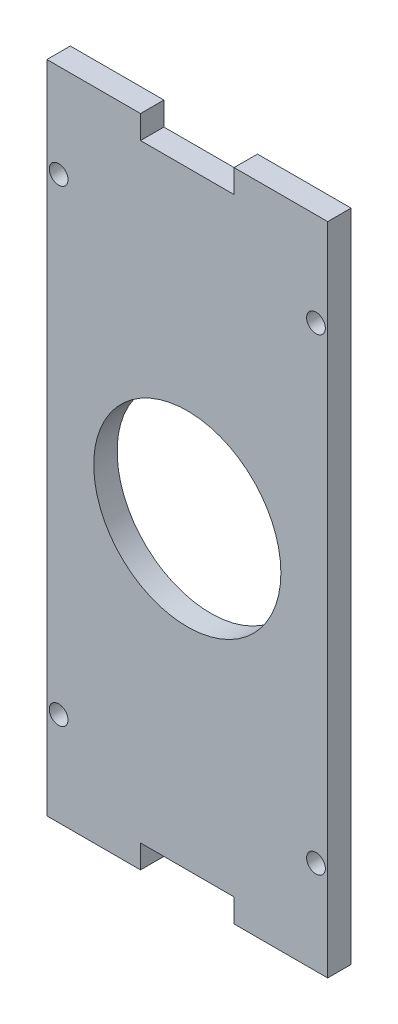
ISO-10303-21;
HEADER;
FILE_DESCRIPTION(('STEP AP214'),'2;1');
FILE_NAME('part.step','',(''),(''),'','','');
FILE_SCHEMA(('AUTOMOTIVE_DESIGN { 1 0 10303 214 1 1 1 1 }'));
ENDSEC;
DATA;
#1=APPLICATION_CONTEXT('core data for automotive mechanical design processes');
#2=APPLICATION_PROTOCOL_DEFINITION('international standard','automotive_design',2000,#1);
#3=PRODUCT_CONTEXT('',#1,'mechanical');
#4=PRODUCT('Part','Part','',(#3));
#5=PRODUCT_RELATED_PRODUCT_CATEGORY('part','',(#4));
#6=PRODUCT_DEFINITION_FORMATION('','',#4);
#7=PRODUCT_DEFINITION_CONTEXT('part definition',#1,'design');
#8=PRODUCT_DEFINITION('design','',#6,#7);
#9=PRODUCT_DEFINITION_SHAPE('','',#8);
#10=(LENGTH_UNIT() NAMED_UNIT(*) SI_UNIT(.MILLI.,.METRE.));
#11=(NAMED_UNIT(*) PLANE_ANGLE_UNIT() SI_UNIT($,.RADIAN.));
#12=(NAMED_UNIT(*) SI_UNIT($,.STERADIAN.) SOLID_ANGLE_UNIT());
#13=UNCERTAINTY_MEASURE_WITH_UNIT(LENGTH_MEASURE(1.E-05),#10,'distance_accuracy_value','');
#14=(GEOMETRIC_REPRESENTATION_CONTEXT(3) GLOBAL_UNCERTAINTY_ASSIGNED_CONTEXT((#13)) GLOBAL_UNIT_ASSIGNED_CONTEXT((#10,
#11,#12)) REPRESENTATION_CONTEXT('',''));
#15=CARTESIAN_POINT('',(0.,0.,0.));
#16=DIRECTION('',(0.,0.,1.));
#17=DIRECTION('',(1.,0.,0.));
#18=AXIS2_PLACEMENT_3D('',#15,#16,#17);
#19=CARTESIAN_POINT('',(0.,65.,5.));
#20=DIRECTION('',(0.,1.,0.));
#21=DIRECTION('',(0.,0.,1.));
#22=AXIS2_PLACEMENT_3D('',#19,#20,#21);
#23=PLANE('',#22);
#24=DIRECTION('',(1.,0.,0.));
#25=VECTOR('',#24,1.);
#26=CARTESIAN_POINT('',(0.,65.,0.));
#27=LINE('',#26,#25);
#28=CARTESIAN_POINT('',(-4.99999999999998,65.,0.));
#29=VERTEX_POINT('',#28);
#30=CARTESIAN_POINT('',(15.,65.,0.));
#31=VERTEX_POINT('',#30);
#32=EDGE_CURVE('E210',#29,#31,#27,.T.);
#33=ORIENTED_EDGE('',*,*,#32,.F.);
#34=DIRECTION('',(0.,0.,-1.));
#35=VECTOR('',#34,1.);
#36=CARTESIAN_POINT('',(-4.99999999999998,65.,5.));
#37=LINE('',#36,#35);
#38=CARTESIAN_POINT('',(-4.99999999999998,65.,5.));
#39=VERTEX_POINT('',#38);
#40=EDGE_CURVE('E11',#39,#29,#37,.T.);
#41=ORIENTED_EDGE('',*,*,#40,.F.);
#42=DIRECTION('',(1.,0.,0.));
#43=VECTOR('',#42,1.);
#44=CARTESIAN_POINT('',(0.,65.,5.));
#45=LINE('',#44,#43);
#46=CARTESIAN_POINT('',(15.,65.,5.));
#47=VERTEX_POINT('',#46);
#48=EDGE_CURVE('E161',#39,#47,#45,.T.);
#49=ORIENTED_EDGE('',*,*,#48,.T.);
#50=DIRECTION('',(0.,0.,-1.));
#51=VECTOR('',#50,1.);
#52=CARTESIAN_POINT('',(15.,65.,5.));
#53=LINE('',#52,#51);
#54=EDGE_CURVE('E99',#47,#31,#53,.T.);
#55=ORIENTED_EDGE('',*,*,#54,.T.);
#56=EDGE_LOOP('',(#33,#41,#49,#55));
#57=FACE_BOUND('',#56,.T.);
#58=ADVANCED_FACE('F35',(#57),#23,.T.);
#59=CARTESIAN_POINT('',(-4.99999999999998,0.,5.));
#60=DIRECTION('',(1.,0.,0.));
#61=DIRECTION('',(0.,0.,-1.));
#62=AXIS2_PLACEMENT_3D('',#59,#60,#61);
#63=PLANE('',#62);
#64=DIRECTION('',(0.,-1.,0.));
#65=VECTOR('',#64,1.);
#66=CARTESIAN_POINT('',(-4.99999999999998,0.,0.));
#67=LINE('',#66,#65);
#68=CARTESIAN_POINT('',(-4.99999999999998,70.,0.));
#69=VERTEX_POINT('',#68);
#70=EDGE_CURVE('E213',#69,#29,#67,.T.);
#71=ORIENTED_EDGE('',*,*,#70,.F.);
#72=DIRECTION('',(0.,0.,-1.));
#73=VECTOR('',#72,1.);
#74=CARTESIAN_POINT('',(-4.99999999999998,70.,5.));
#75=LINE('',#74,#73);
#76=CARTESIAN_POINT('',(-4.99999999999998,70.,5.));
#77=VERTEX_POINT('',#76);
#78=EDGE_CURVE('E44',#77,#69,#75,.T.);
#79=ORIENTED_EDGE('',*,*,#78,.F.);
#80=DIRECTION('',(0.,-1.,0.));
#81=VECTOR('',#80,1.);
#82=CARTESIAN_POINT('',(-4.99999999999998,0.,5.));
#83=LINE('',#82,#81);
#84=EDGE_CURVE('E156',#77,#39,#83,.T.);
#85=ORIENTED_EDGE('',*,*,#84,.T.);
#86=ORIENTED_EDGE('',*,*,#40,.T.);
#87=EDGE_LOOP('',(#71,#79,#85,#86));
#88=FACE_BOUND('',#87,.T.);
#89=ADVANCED_FACE('F204',(#88),#63,.T.);
#90=CARTESIAN_POINT('',(0.,70.,5.));
#91=DIRECTION('',(0.,1.,0.));
#92=DIRECTION('',(-1.,0.,0.));
#93=AXIS2_PLACEMENT_3D('',#90,#91,#92);
#94=PLANE('',#93);
#95=DIRECTION('',(1.,0.,0.));
#96=VECTOR('',#95,1.);
#97=CARTESIAN_POINT('',(0.,70.,0.));
#98=LINE('',#97,#96);
#99=CARTESIAN_POINT('',(-25.,70.,0.));
#100=VERTEX_POINT('',#99);
#101=EDGE_CURVE('E219',#100,#69,#98,.T.);
#102=ORIENTED_EDGE('',*,*,#101,.F.);
#103=DIRECTION('',(0.,0.,-1.));
#104=VECTOR('',#103,1.);
#105=CARTESIAN_POINT('',(-25.,70.,5.));
#106=LINE('',#105,#104);
#107=CARTESIAN_POINT('',(-25.,70.,5.));
#108=VERTEX_POINT('',#107);
#109=EDGE_CURVE('E257',#108,#100,#106,.T.);
#110=ORIENTED_EDGE('',*,*,#109,.F.);
#111=DIRECTION('',(1.,0.,0.));
#112=VECTOR('',#111,1.);
#113=CARTESIAN_POINT('',(0.,70.,5.));
#114=LINE('',#113,#112);
#115=EDGE_CURVE('E150',#108,#77,#114,.T.);
#116=ORIENTED_EDGE('',*,*,#115,.T.);
#117=ORIENTED_EDGE('',*,*,#78,.T.);
#118=EDGE_LOOP('',(#102,#110,#116,#117));
#119=FACE_BOUND('',#118,.T.);
#120=ADVANCED_FACE('F208',(#119),#94,.T.);
#121=CARTESIAN_POINT('',(-25.,0.,5.));
#122=DIRECTION('',(1.,0.,0.));
#123=DIRECTION('',(0.,1.,0.));
#124=AXIS2_PLACEMENT_3D('',#121,#122,#123);
#125=PLANE('',#124);
#126=DIRECTION('',(0.,-1.,0.));
#127=VECTOR('',#126,1.);
#128=CARTESIAN_POINT('',(-25.,0.,0.));
#129=LINE('',#128,#127);
#130=CARTESIAN_POINT('',(-25.,-70.,0.));
#131=VERTEX_POINT('',#130);
#132=EDGE_CURVE('E221',#100,#131,#129,.T.);
#133=ORIENTED_EDGE('',*,*,#132,.T.);
#134=DIRECTION('',(0.,0.,-1.));
#135=VECTOR('',#134,1.);
#136=CARTESIAN_POINT('',(-25.,-70.,5.));
#137=LINE('',#136,#135);
#138=CARTESIAN_POINT('',(-25.,-70.,5.));
#139=VERTEX_POINT('',#138);
#140=EDGE_CURVE('E254',#139,#131,#137,.T.);
#141=ORIENTED_EDGE('',*,*,#140,.F.);
#142=DIRECTION('',(0.,-1.,0.));
#143=VECTOR('',#142,1.);
#144=CARTESIAN_POINT('',(-25.,0.,5.));
#145=LINE('',#144,#143);
#146=EDGE_CURVE('E155',#108,#139,#145,.T.);
#147=ORIENTED_EDGE('',*,*,#146,.F.);
#148=ORIENTED_EDGE('',*,*,#109,.T.);
#149=EDGE_LOOP('',(#133,#141,#147,#148));
#150=FACE_BOUND('',#149,.T.);
#151=ADVANCED_FACE('F319',(#150),#125,.F.);
#152=CARTESIAN_POINT('',(0.,-70.,5.));
#153=DIRECTION('',(0.,1.,0.));
#154=DIRECTION('',(0.,0.,1.));
#155=AXIS2_PLACEMENT_3D('',#152,#153,#154);
#156=PLANE('',#155);
#157=DIRECTION('',(1.,0.,0.));
#158=VECTOR('',#157,1.);
#159=CARTESIAN_POINT('',(0.,-70.,0.));
#160=LINE('',#159,#158);
#161=CARTESIAN_POINT('',(-4.99999999999998,-70.,0.));
#162=VERTEX_POINT('',#161);
#163=EDGE_CURVE('E226',#131,#162,#160,.T.);
#164=ORIENTED_EDGE('',*,*,#163,.T.);
#165=DIRECTION('',(0.,0.,-1.));
#166=VECTOR('',#165,1.);
#167=CARTESIAN_POINT('',(-4.99999999999998,-70.,5.));
#168=LINE('',#167,#166);
#169=CARTESIAN_POINT('',(-4.99999999999998,-70.,5.));
#170=VERTEX_POINT('',#169);
#171=EDGE_CURVE('E252',#170,#162,#168,.T.);
#172=ORIENTED_EDGE('',*,*,#171,.F.);
#173=DIRECTION('',(1.,0.,0.));
#174=VECTOR('',#173,1.);
#175=CARTESIAN_POINT('',(0.,-70.,5.));
#176=LINE('',#175,#174);
#177=EDGE_CURVE('E159',#139,#170,#176,.T.);
#178=ORIENTED_EDGE('',*,*,#177,.F.);
#179=ORIENTED_EDGE('',*,*,#140,.T.);
#180=EDGE_LOOP('',(#164,#172,#178,#179));
#181=FACE_BOUND('',#180,.T.);
#182=ADVANCED_FACE('F315',(#181),#156,.F.);
#183=CARTESIAN_POINT('',(-4.99999999999998,0.,5.));
#184=DIRECTION('',(1.,0.,0.));
#185=DIRECTION('',(0.,0.,-1.));
#186=AXIS2_PLACEMENT_3D('',#183,#184,#185);
#187=PLANE('',#186);
#188=DIRECTION('',(0.,-1.,0.));
#189=VECTOR('',#188,1.);
#190=CARTESIAN_POINT('',(-4.99999999999998,0.,0.));
#191=LINE('',#190,#189);
#192=CARTESIAN_POINT('',(-4.99999999999998,-65.,0.));
#193=VERTEX_POINT('',#192);
#194=EDGE_CURVE('E229',#193,#162,#191,.T.);
#195=ORIENTED_EDGE('',*,*,#194,.F.);
#196=DIRECTION('',(0.,0.,-1.));
#197=VECTOR('',#196,1.);
#198=CARTESIAN_POINT('',(-4.99999999999998,-65.,5.));
#199=LINE('',#198,#197);
#200=CARTESIAN_POINT('',(-4.99999999999998,-65.,5.));
#201=VERTEX_POINT('',#200);
#202=EDGE_CURVE('E250',#201,#193,#199,.T.);
#203=ORIENTED_EDGE('',*,*,#202,.F.);
#204=DIRECTION('',(0.,-1.,0.));
#205=VECTOR('',#204,1.);
#206=CARTESIAN_POINT('',(-4.99999999999998,0.,5.));
#207=LINE('',#206,#205);
#208=EDGE_CURVE('E337',#201,#170,#207,.T.);
#209=ORIENTED_EDGE('',*,*,#208,.T.);
#210=ORIENTED_EDGE('',*,*,#171,.T.);
#211=EDGE_LOOP('',(#195,#203,#209,#210));
#212=FACE_BOUND('',#211,.T.);
#213=ADVANCED_FACE('F311',(#212),#187,.T.);
#214=CARTESIAN_POINT('',(0.,-65.,5.));
#215=DIRECTION('',(0.,1.,0.));
#216=DIRECTION('',(0.,0.,1.));
#217=AXIS2_PLACEMENT_3D('',#214,#215,#216);
#218=PLANE('',#217);
#219=DIRECTION('',(1.,0.,0.));
#220=VECTOR('',#219,1.);
#221=CARTESIAN_POINT('',(0.,-65.,0.));
#222=LINE('',#221,#220);
#223=CARTESIAN_POINT('',(15.,-65.,0.));
#224=VERTEX_POINT('',#223);
#225=EDGE_CURVE('E232',#193,#224,#222,.T.);
#226=ORIENTED_EDGE('',*,*,#225,.T.);
#227=DIRECTION('',(0.,0.,-1.));
#228=VECTOR('',#227,1.);
#229=CARTESIAN_POINT('',(15.,-65.,5.));
#230=LINE('',#229,#228);
#231=CARTESIAN_POINT('',(15.,-65.,5.));
#232=VERTEX_POINT('',#231);
#233=EDGE_CURVE('E247',#232,#224,#230,.T.);
#234=ORIENTED_EDGE('',*,*,#233,.F.);
#235=DIRECTION('',(1.,0.,0.));
#236=VECTOR('',#235,1.);
#237=CARTESIAN_POINT('',(0.,-65.,5.));
#238=LINE('',#237,#236);
#239=EDGE_CURVE('E338',#201,#232,#238,.T.);
#240=ORIENTED_EDGE('',*,*,#239,.F.);
#241=ORIENTED_EDGE('',*,*,#202,.T.);
#242=EDGE_LOOP('',(#226,#234,#240,#241));
#243=FACE_BOUND('',#242,.T.);
#244=ADVANCED_FACE('F307',(#243),#218,.F.);
#245=CARTESIAN_POINT('',(15.,0.,5.));
#246=DIRECTION('',(1.,0.,0.));
#247=DIRECTION('',(0.,1.,0.));
#248=AXIS2_PLACEMENT_3D('',#245,#246,#247);
#249=PLANE('',#248);
#250=DIRECTION('',(0.,-1.,0.));
#251=VECTOR('',#250,1.);
#252=CARTESIAN_POINT('',(15.,0.,0.));
#253=LINE('',#252,#251);
#254=CARTESIAN_POINT('',(15.,-70.,0.));
#255=VERTEX_POINT('',#254);
#256=EDGE_CURVE('E234',#224,#255,#253,.T.);
#257=ORIENTED_EDGE('',*,*,#256,.T.);
#258=DIRECTION('',(0.,0.,-1.));
#259=VECTOR('',#258,1.);
#260=CARTESIAN_POINT('',(15.,-70.,5.));
#261=LINE('',#260,#259);
#262=CARTESIAN_POINT('',(15.,-70.,5.));
#263=VERTEX_POINT('',#262);
#264=EDGE_CURVE('E244',#263,#255,#261,.T.);
#265=ORIENTED_EDGE('',*,*,#264,.F.);
#266=DIRECTION('',(0.,-1.,0.));
#267=VECTOR('',#266,1.);
#268=CARTESIAN_POINT('',(15.,0.,5.));
#269=LINE('',#268,#267);
#270=EDGE_CURVE('E340',#232,#263,#269,.T.);
#271=ORIENTED_EDGE('',*,*,#270,.F.);
#272=ORIENTED_EDGE('',*,*,#233,.T.);
#273=EDGE_LOOP('',(#257,#265,#271,#272));
#274=FACE_BOUND('',#273,.T.);
#275=ADVANCED_FACE('F303',(#274),#249,.F.);
#276=CARTESIAN_POINT('',(0.,-70.,5.));
#277=DIRECTION('',(0.,1.,0.));
#278=DIRECTION('',(0.,0.,1.));
#279=AXIS2_PLACEMENT_3D('',#276,#277,#278);
#280=PLANE('',#279);
#281=DIRECTION('',(1.,0.,0.));
#282=VECTOR('',#281,1.);
#283=CARTESIAN_POINT('',(0.,-70.,0.));
#284=LINE('',#283,#282);
#285=CARTESIAN_POINT('',(35.,-70.,0.));
#286=VERTEX_POINT('',#285);
#287=EDGE_CURVE('E236',#255,#286,#284,.T.);
#288=ORIENTED_EDGE('',*,*,#287,.T.);
#289=DIRECTION('',(0.,0.,-1.));
#290=VECTOR('',#289,1.);
#291=CARTESIAN_POINT('',(35.,-70.,5.));
#292=LINE('',#291,#290);
#293=CARTESIAN_POINT('',(35.,-70.,5.));
#294=VERTEX_POINT('',#293);
#295=EDGE_CURVE('E140',#294,#286,#292,.T.);
#296=ORIENTED_EDGE('',*,*,#295,.F.);
#297=DIRECTION('',(1.,0.,0.));
#298=VECTOR('',#297,1.);
#299=CARTESIAN_POINT('',(0.,-70.,5.));
#300=LINE('',#299,#298);
#301=EDGE_CURVE('E145',#263,#294,#300,.T.);
#302=ORIENTED_EDGE('',*,*,#301,.F.);
#303=ORIENTED_EDGE('',*,*,#264,.T.);
#304=EDGE_LOOP('',(#288,#296,#302,#303));
#305=FACE_BOUND('',#304,.T.);
#306=ADVANCED_FACE('F300',(#305),#280,.F.);
#307=CARTESIAN_POINT('',(35.,0.,5.));
#308=DIRECTION('',(1.,0.,0.));
#309=DIRECTION('',(0.,0.,-1.));
#310=AXIS2_PLACEMENT_3D('',#307,#308,#309);
#311=PLANE('',#310);
#312=DIRECTION('',(0.,-1.,0.));
#313=VECTOR('',#312,1.);
#314=CARTESIAN_POINT('',(35.,0.,0.));
#315=LINE('',#314,#313);
#316=CARTESIAN_POINT('',(35.,70.,0.));
#317=VERTEX_POINT('',#316);
#318=EDGE_CURVE('E135',#317,#286,#315,.T.);
#319=ORIENTED_EDGE('',*,*,#318,.F.);
#320=DIRECTION('',(0.,0.,-1.));
#321=VECTOR('',#320,1.);
#322=CARTESIAN_POINT('',(35.,70.,5.));
#323=LINE('',#322,#321);
#324=CARTESIAN_POINT('',(35.,70.,5.));
#325=VERTEX_POINT('',#324);
#326=EDGE_CURVE('E130',#325,#317,#323,.T.);
#327=ORIENTED_EDGE('',*,*,#326,.F.);
#328=DIRECTION('',(0.,-1.,0.));
#329=VECTOR('',#328,1.);
#330=CARTESIAN_POINT('',(35.,0.,5.));
#331=LINE('',#330,#329);
#332=EDGE_CURVE('E133',#325,#294,#331,.T.);
#333=ORIENTED_EDGE('',*,*,#332,.T.);
#334=ORIENTED_EDGE('',*,*,#295,.T.);
#335=EDGE_LOOP('',(#319,#327,#333,#334));
#336=FACE_BOUND('',#335,.T.);
#337=ADVANCED_FACE('F132',(#336),#311,.T.);
#338=CARTESIAN_POINT('',(15.,70.,0.));
#339=VERTEX_POINT('',#338);
#340=EDGE_CURVE('E223',#339,#317,#98,.T.);
#341=ORIENTED_EDGE('',*,*,#340,.F.);
#342=DIRECTION('',(0.,0.,-1.));
#343=VECTOR('',#342,1.);
#344=CARTESIAN_POINT('',(15.,70.,5.));
#345=LINE('',#344,#343);
#346=CARTESIAN_POINT('',(15.,70.,5.));
#347=VERTEX_POINT('',#346);
#348=EDGE_CURVE('E92',#347,#339,#345,.T.);
#349=ORIENTED_EDGE('',*,*,#348,.F.);
#350=EDGE_CURVE('E143',#347,#325,#114,.T.);
#351=ORIENTED_EDGE('',*,*,#350,.T.);
#352=ORIENTED_EDGE('',*,*,#326,.T.);
#353=EDGE_LOOP('',(#341,#349,#351,#352));
#354=FACE_BOUND('',#353,.T.);
#355=ADVANCED_FACE('F148',(#354),#94,.T.);
#356=CARTESIAN_POINT('',(15.,0.,5.));
#357=DIRECTION('',(1.,0.,0.));
#358=DIRECTION('',(0.,0.,-1.));
#359=AXIS2_PLACEMENT_3D('',#356,#357,#358);
#360=PLANE('',#359);
#361=DIRECTION('',(0.,-1.,0.));
#362=VECTOR('',#361,1.);
#363=CARTESIAN_POINT('',(15.,0.,0.));
#364=LINE('',#363,#362);
#365=EDGE_CURVE('E164',#339,#31,#364,.T.);
#366=ORIENTED_EDGE('',*,*,#365,.T.);
#367=ORIENTED_EDGE('',*,*,#54,.F.);
#368=DIRECTION('',(0.,-1.,0.));
#369=VECTOR('',#368,1.);
#370=CARTESIAN_POINT('',(15.,0.,5.));
#371=LINE('',#370,#369);
#372=EDGE_CURVE('E53',#347,#47,#371,.T.);
#373=ORIENTED_EDGE('',*,*,#372,.F.);
#374=ORIENTED_EDGE('',*,*,#348,.T.);
#375=EDGE_LOOP('',(#366,#367,#373,#374));
#376=FACE_BOUND('',#375,.T.);
#377=ADVANCED_FACE('F291',(#376),#360,.F.);
#378=CARTESIAN_POINT('',(0.,0.,5.));
#379=DIRECTION('',(0.,0.,1.));
#380=DIRECTION('',(1.,0.,0.));
#381=AXIS2_PLACEMENT_3D('',#378,#379,#380);
#382=PLANE('',#381);
#383=CARTESIAN_POINT('',(5.,0.,5.));
#384=DIRECTION('',(0.,0.,1.));
#385=DIRECTION('',(1.,0.,0.));
#386=AXIS2_PLACEMENT_3D('',#383,#384,#385);
#387=CIRCLE('',#386,20.);
#388=CARTESIAN_POINT('',(25.,0.,5.));
#389=VERTEX_POINT('',#388);
#390=EDGE_CURVE('E183',#389,#389,#387,.T.);
#391=ORIENTED_EDGE('',*,*,#390,.F.);
#392=EDGE_LOOP('',(#391));
#393=FACE_BOUND('',#392,.T.);
#394=CARTESIAN_POINT('',(32.499999999999,-50.,5.));
#395=DIRECTION('',(0.,0.,-1.));
#396=DIRECTION('',(-1.,0.,0.));
#397=AXIS2_PLACEMENT_3D('',#394,#395,#396);
#398=CIRCLE('',#397,2.);
#399=CARTESIAN_POINT('',(30.499999999999,-50.,5.));
#400=VERTEX_POINT('',#399);
#401=EDGE_CURVE('E180',#400,#400,#398,.T.);
#402=ORIENTED_EDGE('',*,*,#401,.T.);
#403=EDGE_LOOP('',(#402));
#404=FACE_BOUND('',#403,.T.);
#405=CARTESIAN_POINT('',(32.5,50.,5.));
#406=DIRECTION('',(0.,0.,-1.));
#407=DIRECTION('',(-1.,0.,0.));
#408=AXIS2_PLACEMENT_3D('',#405,#406,#407);
#409=CIRCLE('',#408,2.);
#410=CARTESIAN_POINT('',(30.5,50.,5.));
#411=VERTEX_POINT('',#410);
#412=EDGE_CURVE('E176',#411,#411,#409,.T.);
#413=ORIENTED_EDGE('',*,*,#412,.T.);
#414=EDGE_LOOP('',(#413));
#415=FACE_BOUND('',#414,.T.);
#416=CARTESIAN_POINT('',(-22.499999999999,-50.,5.));
#417=DIRECTION('',(0.,0.,1.));
#418=DIRECTION('',(1.,0.,0.));
#419=AXIS2_PLACEMENT_3D('',#416,#417,#418);
#420=CIRCLE('',#419,2.);
#421=CARTESIAN_POINT('',(-20.4999999999989,-50.,5.));
#422=VERTEX_POINT('',#421);
#423=EDGE_CURVE('E172',#422,#422,#420,.T.);
#424=ORIENTED_EDGE('',*,*,#423,.F.);
#425=EDGE_LOOP('',(#424));
#426=FACE_BOUND('',#425,.T.);
#427=CARTESIAN_POINT('',(-22.5,50.,5.));
#428=DIRECTION('',(0.,0.,1.));
#429=DIRECTION('',(1.,0.,0.));
#430=AXIS2_PLACEMENT_3D('',#427,#428,#429);
#431=CIRCLE('',#430,2.);
#432=CARTESIAN_POINT('',(-20.5,50.,5.));
#433=VERTEX_POINT('',#432);
#434=EDGE_CURVE('E167',#433,#433,#431,.T.);
#435=ORIENTED_EDGE('',*,*,#434,.F.);
#436=EDGE_LOOP('',(#435));
#437=FACE_BOUND('',#436,.T.);
#438=ORIENTED_EDGE('',*,*,#48,.F.);
#439=ORIENTED_EDGE('',*,*,#84,.F.);
#440=ORIENTED_EDGE('',*,*,#115,.F.);
#441=ORIENTED_EDGE('',*,*,#146,.T.);
#442=ORIENTED_EDGE('',*,*,#177,.T.);
#443=ORIENTED_EDGE('',*,*,#208,.F.);
#444=ORIENTED_EDGE('',*,*,#239,.T.);
#445=ORIENTED_EDGE('',*,*,#270,.T.);
#446=ORIENTED_EDGE('',*,*,#301,.T.);
#447=ORIENTED_EDGE('',*,*,#332,.F.);
#448=ORIENTED_EDGE('',*,*,#350,.F.);
#449=ORIENTED_EDGE('',*,*,#372,.T.);
#450=EDGE_LOOP('',(#438,#439,#440,#441,#442,#443,#444,#445,#446,#447,#448,#449));
#451=FACE_BOUND('',#450,.T.);
#452=ADVANCED_FACE('F142',(#393,#404,#415,#426,#437,#451),#382,.T.);
#453=CARTESIAN_POINT('',(0.,0.,0.));
#454=DIRECTION('',(0.,0.,1.));
#455=DIRECTION('',(1.,0.,0.));
#456=AXIS2_PLACEMENT_3D('',#453,#454,#455);
#457=PLANE('',#456);
#458=CARTESIAN_POINT('',(5.,0.,0.));
#459=DIRECTION('',(0.,0.,1.));
#460=DIRECTION('',(1.,0.,0.));
#461=AXIS2_PLACEMENT_3D('',#458,#459,#460);
#462=CIRCLE('',#461,20.);
#463=CARTESIAN_POINT('',(25.,0.,0.));
#464=VERTEX_POINT('',#463);
#465=EDGE_CURVE('E38',#464,#464,#462,.T.);
#466=ORIENTED_EDGE('',*,*,#465,.T.);
#467=EDGE_LOOP('',(#466));
#468=FACE_BOUND('',#467,.T.);
#469=CARTESIAN_POINT('',(32.499999999999,-50.,0.));
#470=DIRECTION('',(0.,0.,1.));
#471=DIRECTION('',(1.,0.,0.));
#472=AXIS2_PLACEMENT_3D('',#469,#470,#471);
#473=CIRCLE('',#472,2.);
#474=CARTESIAN_POINT('',(34.499999999999,-50.,0.));
#475=VERTEX_POINT('',#474);
#476=EDGE_CURVE('E179',#475,#475,#473,.F.);
#477=ORIENTED_EDGE('',*,*,#476,.F.);
#478=EDGE_LOOP('',(#477));
#479=FACE_BOUND('',#478,.T.);
#480=CARTESIAN_POINT('',(32.5,50.,0.));
#481=DIRECTION('',(0.,0.,1.));
#482=DIRECTION('',(1.,0.,0.));
#483=AXIS2_PLACEMENT_3D('',#480,#481,#482);
#484=CIRCLE('',#483,2.);
#485=CARTESIAN_POINT('',(34.5,50.,0.));
#486=VERTEX_POINT('',#485);
#487=EDGE_CURVE('E175',#486,#486,#484,.F.);
#488=ORIENTED_EDGE('',*,*,#487,.F.);
#489=EDGE_LOOP('',(#488));
#490=FACE_BOUND('',#489,.T.);
#491=CARTESIAN_POINT('',(-22.499999999999,-50.,0.));
#492=DIRECTION('',(0.,0.,1.));
#493=DIRECTION('',(1.,0.,0.));
#494=AXIS2_PLACEMENT_3D('',#491,#492,#493);
#495=CIRCLE('',#494,2.);
#496=CARTESIAN_POINT('',(-20.4999999999989,-50.,0.));
#497=VERTEX_POINT('',#496);
#498=EDGE_CURVE('E171',#497,#497,#495,.T.);
#499=ORIENTED_EDGE('',*,*,#498,.T.);
#500=EDGE_LOOP('',(#499));
#501=FACE_BOUND('',#500,.T.);
#502=CARTESIAN_POINT('',(-22.5,50.,0.));
#503=DIRECTION('',(0.,0.,1.));
#504=DIRECTION('',(1.,0.,0.));
#505=AXIS2_PLACEMENT_3D('',#502,#503,#504);
#506=CIRCLE('',#505,2.);
#507=CARTESIAN_POINT('',(-20.5,50.,0.));
#508=VERTEX_POINT('',#507);
#509=EDGE_CURVE('E170',#508,#508,#506,.T.);
#510=ORIENTED_EDGE('',*,*,#509,.T.);
#511=EDGE_LOOP('',(#510));
#512=FACE_BOUND('',#511,.T.);
#513=ORIENTED_EDGE('',*,*,#32,.T.);
#514=ORIENTED_EDGE('',*,*,#365,.F.);
#515=ORIENTED_EDGE('',*,*,#340,.T.);
#516=ORIENTED_EDGE('',*,*,#318,.T.);
#517=ORIENTED_EDGE('',*,*,#287,.F.);
#518=ORIENTED_EDGE('',*,*,#256,.F.);
#519=ORIENTED_EDGE('',*,*,#225,.F.);
#520=ORIENTED_EDGE('',*,*,#194,.T.);
#521=ORIENTED_EDGE('',*,*,#163,.F.);
#522=ORIENTED_EDGE('',*,*,#132,.F.);
#523=ORIENTED_EDGE('',*,*,#101,.T.);
#524=ORIENTED_EDGE('',*,*,#70,.T.);
#525=EDGE_LOOP('',(#513,#514,#515,#516,#517,#518,#519,#520,#521,#522,#523,#524));
#526=FACE_BOUND('',#525,.T.);
#527=ADVANCED_FACE('F190',(#468,#479,#490,#501,#512,#526),#457,.F.);
#528=CARTESIAN_POINT('',(-22.5,50.,-5.));
#529=DIRECTION('',(0.,0.,1.));
#530=DIRECTION('',(1.,0.,0.));
#531=AXIS2_PLACEMENT_3D('',#528,#529,#530);
#532=CYLINDRICAL_SURFACE('',#531,2.);
#533=ORIENTED_EDGE('',*,*,#434,.T.);
#534=EDGE_LOOP('',(#533));
#535=FACE_BOUND('',#534,.T.);
#536=ORIENTED_EDGE('',*,*,#509,.F.);
#537=EDGE_LOOP('',(#536));
#538=FACE_BOUND('',#537,.T.);
#539=ADVANCED_FACE('F270',(#535,#538),#532,.F.);
#540=CARTESIAN_POINT('',(-22.499999999999,-50.,-5.));
#541=DIRECTION('',(0.,0.,1.));
#542=DIRECTION('',(1.,0.,0.));
#543=AXIS2_PLACEMENT_3D('',#540,#541,#542);
#544=CYLINDRICAL_SURFACE('',#543,2.);
#545=ORIENTED_EDGE('',*,*,#423,.T.);
#546=EDGE_LOOP('',(#545));
#547=FACE_BOUND('',#546,.T.);
#548=ORIENTED_EDGE('',*,*,#498,.F.);
#549=EDGE_LOOP('',(#548));
#550=FACE_BOUND('',#549,.T.);
#551=ADVANCED_FACE('F279',(#547,#550),#544,.F.);
#552=CARTESIAN_POINT('',(32.5,50.,-5.));
#553=DIRECTION('',(0.,0.,1.));
#554=DIRECTION('',(1.,0.,0.));
#555=AXIS2_PLACEMENT_3D('',#552,#553,#554);
#556=CYLINDRICAL_SURFACE('',#555,2.);
#557=ORIENTED_EDGE('',*,*,#412,.F.);
#558=EDGE_LOOP('',(#557));
#559=FACE_BOUND('',#558,.T.);
#560=ORIENTED_EDGE('',*,*,#487,.T.);
#561=EDGE_LOOP('',(#560));
#562=FACE_BOUND('',#561,.T.);
#563=ADVANCED_FACE('F200',(#559,#562),#556,.F.);
#564=CARTESIAN_POINT('',(32.499999999999,-50.,-5.));
#565=DIRECTION('',(0.,0.,1.));
#566=DIRECTION('',(1.,0.,0.));
#567=AXIS2_PLACEMENT_3D('',#564,#565,#566);
#568=CYLINDRICAL_SURFACE('',#567,2.);
#569=ORIENTED_EDGE('',*,*,#401,.F.);
#570=EDGE_LOOP('',(#569));
#571=FACE_BOUND('',#570,.T.);
#572=ORIENTED_EDGE('',*,*,#476,.T.);
#573=EDGE_LOOP('',(#572));
#574=FACE_BOUND('',#573,.T.);
#575=ADVANCED_FACE('F195',(#571,#574),#568,.F.);
#576=CARTESIAN_POINT('',(5.,0.,-295.));
#577=DIRECTION('',(0.,0.,1.));
#578=DIRECTION('',(1.,0.,0.));
#579=AXIS2_PLACEMENT_3D('',#576,#577,#578);
#580=CYLINDRICAL_SURFACE('',#579,20.);
#581=ORIENTED_EDGE('',*,*,#390,.T.);
#582=EDGE_LOOP('',(#581));
#583=FACE_BOUND('',#582,.T.);
#584=ORIENTED_EDGE('',*,*,#465,.F.);
#585=EDGE_LOOP('',(#584));
#586=FACE_BOUND('',#585,.T.);
#587=ADVANCED_FACE('F193',(#583,#586),#580,.F.);
#588=CLOSED_SHELL('',(#58,#89,#120,#151,#182,#213,#244,#275,#306,#337,#355,#377,#452,#527,#539,
#551,#563,#575,#587));
#589=MANIFOLD_SOLID_BREP('B2',#588);
#590=ADVANCED_BREP_SHAPE_REPRESENTATION('',(#18,#589),#14);
#591=SHAPE_DEFINITION_REPRESENTATION(#9,#590);
ENDSEC;
END-ISO-10303-21;
